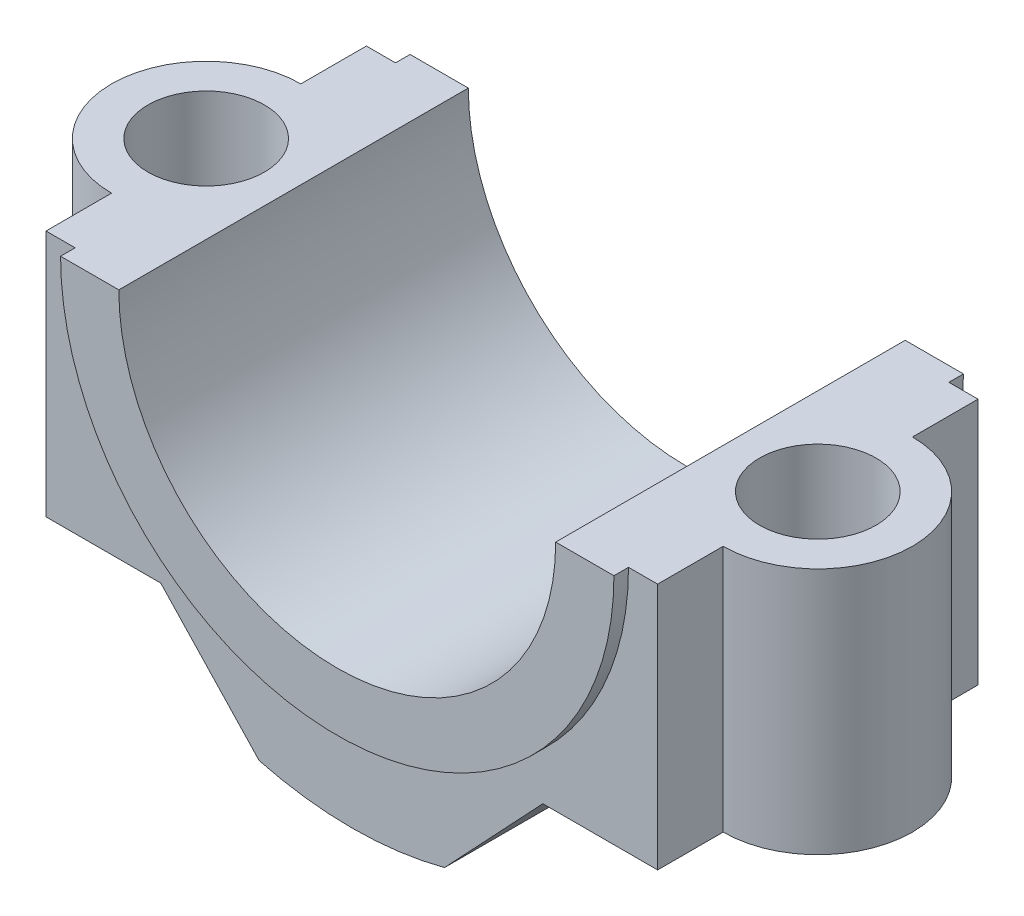
ISO-10303-21;
HEADER;
FILE_DESCRIPTION(('STEP AP214'),'2;1');
FILE_NAME('part.step','',(''),(''),'','','');
FILE_SCHEMA(('AUTOMOTIVE_DESIGN { 1 0 10303 214 1 1 1 1 }'));
ENDSEC;
DATA;
#1=APPLICATION_CONTEXT('core data for automotive mechanical design processes');
#2=APPLICATION_PROTOCOL_DEFINITION('international standard','automotive_design',2000,#1);
#3=PRODUCT_CONTEXT('',#1,'mechanical');
#4=PRODUCT('Part','Part','',(#3));
#5=PRODUCT_RELATED_PRODUCT_CATEGORY('part','',(#4));
#6=PRODUCT_DEFINITION_FORMATION('','',#4);
#7=PRODUCT_DEFINITION_CONTEXT('part definition',#1,'design');
#8=PRODUCT_DEFINITION('design','',#6,#7);
#9=PRODUCT_DEFINITION_SHAPE('','',#8);
#10=(LENGTH_UNIT() NAMED_UNIT(*) SI_UNIT(.MILLI.,.METRE.));
#11=(NAMED_UNIT(*) PLANE_ANGLE_UNIT() SI_UNIT($,.RADIAN.));
#12=(NAMED_UNIT(*) SI_UNIT($,.STERADIAN.) SOLID_ANGLE_UNIT());
#13=UNCERTAINTY_MEASURE_WITH_UNIT(LENGTH_MEASURE(1.E-05),#10,'distance_accuracy_value','');
#14=(GEOMETRIC_REPRESENTATION_CONTEXT(3) GLOBAL_UNCERTAINTY_ASSIGNED_CONTEXT((#13)) GLOBAL_UNIT_ASSIGNED_CONTEXT((#10,
#11,#12)) REPRESENTATION_CONTEXT('',''));
#15=CARTESIAN_POINT('',(0.,0.,0.));
#16=DIRECTION('',(0.,0.,1.));
#17=DIRECTION('',(1.,0.,0.));
#18=AXIS2_PLACEMENT_3D('',#15,#16,#17);
#19=CARTESIAN_POINT('',(0.,95.,-11.));
#20=DIRECTION('',(0.,-1.,0.));
#21=DIRECTION('',(0.,0.,-1.));
#22=AXIS2_PLACEMENT_3D('',#19,#20,#21);
#23=PLANE('',#22);
#24=CARTESIAN_POINT('',(21.,95.,0.));
#25=DIRECTION('',(0.,1.,0.));
#26=DIRECTION('',(0.,0.,1.));
#27=AXIS2_PLACEMENT_3D('',#24,#25,#26);
#28=CIRCLE('',#27,4.);
#29=CARTESIAN_POINT('',(21.,95.,4.));
#30=VERTEX_POINT('',#29);
#31=EDGE_CURVE('E231',#30,#30,#28,.T.);
#32=ORIENTED_EDGE('',*,*,#31,.F.);
#33=EDGE_LOOP('',(#32));
#34=FACE_BOUND('',#33,.T.);
#35=DIRECTION('',(0.,0.,1.));
#36=VECTOR('',#35,1.);
#37=CARTESIAN_POINT('',(21.,95.,-11.));
#38=LINE('',#37,#36);
#39=CARTESIAN_POINT('',(21.,95.,6.50000000000001));
#40=VERTEX_POINT('',#39);
#41=CARTESIAN_POINT('',(21.,95.,11.));
#42=VERTEX_POINT('',#41);
#43=EDGE_CURVE('E217',#40,#42,#38,.T.);
#44=ORIENTED_EDGE('',*,*,#43,.F.);
#45=CARTESIAN_POINT('',(21.,95.,0.));
#46=DIRECTION('',(0.,-1.,0.));
#47=DIRECTION('',(0.,0.,-1.));
#48=AXIS2_PLACEMENT_3D('',#45,#46,#47);
#49=CIRCLE('',#48,6.50000000000001);
#50=CARTESIAN_POINT('',(21.,95.,-6.50000000000001));
#51=VERTEX_POINT('',#50);
#52=EDGE_CURVE('E226',#51,#40,#49,.T.);
#53=ORIENTED_EDGE('',*,*,#52,.F.);
#54=DIRECTION('',(0.,0.,1.));
#55=VECTOR('',#54,1.);
#56=CARTESIAN_POINT('',(21.,95.,-11.));
#57=LINE('',#56,#55);
#58=CARTESIAN_POINT('',(21.,95.,-11.));
#59=VERTEX_POINT('',#58);
#60=EDGE_CURVE('E223',#59,#51,#57,.T.);
#61=ORIENTED_EDGE('',*,*,#60,.F.);
#62=DIRECTION('',(1.,0.,0.));
#63=VECTOR('',#62,1.);
#64=CARTESIAN_POINT('',(0.,95.,-11.));
#65=LINE('',#64,#63);
#66=CARTESIAN_POINT('',(19.,95.,-11.));
#67=VERTEX_POINT('',#66);
#68=EDGE_CURVE('E254',#67,#59,#65,.T.);
#69=ORIENTED_EDGE('',*,*,#68,.F.);
#70=DIRECTION('',(0.,0.,1.));
#71=VECTOR('',#70,1.);
#72=CARTESIAN_POINT('',(19.,95.,-12.));
#73=LINE('',#72,#71);
#74=CARTESIAN_POINT('',(19.,95.,-12.));
#75=VERTEX_POINT('',#74);
#76=EDGE_CURVE('E259',#75,#67,#73,.T.);
#77=ORIENTED_EDGE('',*,*,#76,.F.);
#78=DIRECTION('',(1.,0.,0.));
#79=VECTOR('',#78,1.);
#80=CARTESIAN_POINT('',(15.,95.,-12.));
#81=LINE('',#80,#79);
#82=CARTESIAN_POINT('',(15.,95.,-12.));
#83=VERTEX_POINT('',#82);
#84=EDGE_CURVE('E235',#83,#75,#81,.T.);
#85=ORIENTED_EDGE('',*,*,#84,.F.);
#86=DIRECTION('',(0.,0.,1.));
#87=VECTOR('',#86,1.);
#88=CARTESIAN_POINT('',(15.,95.,-11.));
#89=LINE('',#88,#87);
#90=CARTESIAN_POINT('',(15.,95.,12.));
#91=VERTEX_POINT('',#90);
#92=EDGE_CURVE('E271',#83,#91,#89,.T.);
#93=ORIENTED_EDGE('',*,*,#92,.T.);
#94=DIRECTION('',(1.,0.,0.));
#95=VECTOR('',#94,1.);
#96=CARTESIAN_POINT('',(15.,95.,12.));
#97=LINE('',#96,#95);
#98=CARTESIAN_POINT('',(19.,95.,12.));
#99=VERTEX_POINT('',#98);
#100=EDGE_CURVE('E249',#91,#99,#97,.T.);
#101=ORIENTED_EDGE('',*,*,#100,.T.);
#102=DIRECTION('',(0.,0.,-1.));
#103=VECTOR('',#102,1.);
#104=CARTESIAN_POINT('',(19.,95.,12.));
#105=LINE('',#104,#103);
#106=CARTESIAN_POINT('',(19.,95.,11.));
#107=VERTEX_POINT('',#106);
#108=EDGE_CURVE('E335',#99,#107,#105,.T.);
#109=ORIENTED_EDGE('',*,*,#108,.T.);
#110=DIRECTION('',(1.,0.,0.));
#111=VECTOR('',#110,1.);
#112=CARTESIAN_POINT('',(0.,95.,11.));
#113=LINE('',#112,#111);
#114=EDGE_CURVE('E281',#107,#42,#113,.T.);
#115=ORIENTED_EDGE('',*,*,#114,.T.);
#116=EDGE_LOOP('',(#44,#53,#61,#69,#77,#85,#93,#101,#109,#115));
#117=FACE_BOUND('',#116,.T.);
#118=ADVANCED_FACE('F36',(#34,#117),#23,.F.);
#119=CARTESIAN_POINT('',(0.,0.,11.));
#120=DIRECTION('',(0.,0.,1.));
#121=DIRECTION('',(1.,0.,0.));
#122=AXIS2_PLACEMENT_3D('',#119,#120,#121);
#123=PLANE('',#122);
#124=CARTESIAN_POINT('',(0.,95.,11.));
#125=DIRECTION('',(0.,0.,-1.));
#126=DIRECTION('',(-1.,0.,0.));
#127=AXIS2_PLACEMENT_3D('',#124,#125,#126);
#128=CIRCLE('',#127,19.);
#129=CARTESIAN_POINT('',(-19.,95.,11.));
#130=VERTEX_POINT('',#129);
#131=EDGE_CURVE('E264',#107,#130,#128,.T.);
#132=ORIENTED_EDGE('',*,*,#131,.T.);
#133=DIRECTION('',(1.,0.,0.));
#134=VECTOR('',#133,1.);
#135=CARTESIAN_POINT('',(0.,95.,11.));
#136=LINE('',#135,#134);
#137=CARTESIAN_POINT('',(-21.,95.,11.));
#138=VERTEX_POINT('',#137);
#139=EDGE_CURVE('E165',#138,#130,#136,.T.);
#140=ORIENTED_EDGE('',*,*,#139,.F.);
#141=DIRECTION('',(0.,-1.,0.));
#142=VECTOR('',#141,1.);
#143=CARTESIAN_POINT('',(-21.,95.00005,11.));
#144=LINE('',#143,#142);
#145=CARTESIAN_POINT('',(-21.,78.,11.));
#146=VERTEX_POINT('',#145);
#147=EDGE_CURVE('E160',#138,#146,#144,.T.);
#148=ORIENTED_EDGE('',*,*,#147,.T.);
#149=DIRECTION('',(-1.,0.,0.));
#150=VECTOR('',#149,1.);
#151=CARTESIAN_POINT('',(0.,78.,11.));
#152=LINE('',#151,#150);
#153=CARTESIAN_POINT('',(-13.1176470588236,78.,11.));
#154=VERTEX_POINT('',#153);
#155=EDGE_CURVE('E163',#154,#146,#152,.T.);
#156=ORIENTED_EDGE('',*,*,#155,.F.);
#157=DIRECTION('',(-0.685364699004992,0.728199992692802,0.));
#158=VECTOR('',#157,1.);
#159=CARTESIAN_POINT('',(31.9724770642202,30.0917431192661,11.));
#160=LINE('',#159,#158);
#161=CARTESIAN_POINT('',(-6.36315606092313,70.8233533147308,11.));
#162=VERTEX_POINT('',#161);
#163=EDGE_CURVE('E298',#154,#162,#160,.F.);
#164=ORIENTED_EDGE('',*,*,#163,.T.);
#165=CARTESIAN_POINT('',(0.,95.,11.));
#166=DIRECTION('',(0.,0.,1.));
#167=DIRECTION('',(1.,0.,0.));
#168=AXIS2_PLACEMENT_3D('',#165,#166,#167);
#169=CIRCLE('',#168,25.);
#170=CARTESIAN_POINT('',(6.36315606092294,70.8233533147308,11.));
#171=VERTEX_POINT('',#170);
#172=EDGE_CURVE('E285',#162,#171,#169,.T.);
#173=ORIENTED_EDGE('',*,*,#172,.T.);
#174=DIRECTION('',(-0.685364699004994,-0.7281999926928,0.));
#175=VECTOR('',#174,1.);
#176=CARTESIAN_POINT('',(-31.9724770642203,30.0917431192664,11.));
#177=LINE('',#176,#175);
#178=CARTESIAN_POINT('',(13.1176470588234,78.,11.));
#179=VERTEX_POINT('',#178);
#180=EDGE_CURVE('E307',#171,#179,#177,.F.);
#181=ORIENTED_EDGE('',*,*,#180,.T.);
#182=CARTESIAN_POINT('',(21.,78.,11.));
#183=VERTEX_POINT('',#182);
#184=EDGE_CURVE('E180',#183,#179,#152,.T.);
#185=ORIENTED_EDGE('',*,*,#184,.F.);
#186=DIRECTION('',(0.,-1.,0.));
#187=VECTOR('',#186,1.);
#188=CARTESIAN_POINT('',(21.,95.00005,11.));
#189=LINE('',#188,#187);
#190=EDGE_CURVE('E215',#42,#183,#189,.T.);
#191=ORIENTED_EDGE('',*,*,#190,.F.);
#192=ORIENTED_EDGE('',*,*,#114,.F.);
#193=EDGE_LOOP('',(#132,#140,#148,#156,#164,#173,#181,#185,#191,#192));
#194=FACE_BOUND('',#193,.T.);
#195=ADVANCED_FACE('F162',(#194),#123,.T.);
#196=CARTESIAN_POINT('',(0.,0.,-11.));
#197=DIRECTION('',(0.,0.,1.));
#198=DIRECTION('',(1.,0.,0.));
#199=AXIS2_PLACEMENT_3D('',#196,#197,#198);
#200=PLANE('',#199);
#201=DIRECTION('',(0.685364699004992,-0.728199992692802,0.));
#202=VECTOR('',#201,1.);
#203=CARTESIAN_POINT('',(-15.0000000000001,80.0000000000001,-11.));
#204=LINE('',#203,#202);
#205=CARTESIAN_POINT('',(-6.36315606092314,70.8233533147308,-11.));
#206=VERTEX_POINT('',#205);
#207=CARTESIAN_POINT('',(-13.1176470588236,78.,-11.));
#208=VERTEX_POINT('',#207);
#209=EDGE_CURVE('E302',#206,#208,#204,.F.);
#210=ORIENTED_EDGE('',*,*,#209,.T.);
#211=DIRECTION('',(1.,0.,0.));
#212=VECTOR('',#211,1.);
#213=CARTESIAN_POINT('',(0.,78.,-11.));
#214=LINE('',#213,#212);
#215=CARTESIAN_POINT('',(-21.,78.,-11.));
#216=VERTEX_POINT('',#215);
#217=EDGE_CURVE('E195',#216,#208,#214,.T.);
#218=ORIENTED_EDGE('',*,*,#217,.F.);
#219=DIRECTION('',(0.,-1.,0.));
#220=VECTOR('',#219,1.);
#221=CARTESIAN_POINT('',(-21.,95.00005,-11.));
#222=LINE('',#221,#220);
#223=CARTESIAN_POINT('',(-21.,95.,-11.));
#224=VERTEX_POINT('',#223);
#225=EDGE_CURVE('E170',#224,#216,#222,.T.);
#226=ORIENTED_EDGE('',*,*,#225,.F.);
#227=DIRECTION('',(1.,0.,0.));
#228=VECTOR('',#227,1.);
#229=CARTESIAN_POINT('',(0.,95.,-11.));
#230=LINE('',#229,#228);
#231=CARTESIAN_POINT('',(-19.,95.,-11.));
#232=VERTEX_POINT('',#231);
#233=EDGE_CURVE('E267',#224,#232,#230,.T.);
#234=ORIENTED_EDGE('',*,*,#233,.T.);
#235=CARTESIAN_POINT('',(0.,95.,-11.));
#236=DIRECTION('',(0.,0.,-1.));
#237=DIRECTION('',(-1.,0.,0.));
#238=AXIS2_PLACEMENT_3D('',#235,#236,#237);
#239=CIRCLE('',#238,19.);
#240=EDGE_CURVE('E234',#67,#232,#239,.T.);
#241=ORIENTED_EDGE('',*,*,#240,.F.);
#242=ORIENTED_EDGE('',*,*,#68,.T.);
#243=DIRECTION('',(0.,-1.,0.));
#244=VECTOR('',#243,1.);
#245=CARTESIAN_POINT('',(21.,95.00005,-11.));
#246=LINE('',#245,#244);
#247=CARTESIAN_POINT('',(21.,78.,-11.));
#248=VERTEX_POINT('',#247);
#249=EDGE_CURVE('E221',#59,#248,#246,.T.);
#250=ORIENTED_EDGE('',*,*,#249,.T.);
#251=CARTESIAN_POINT('',(13.1176470588234,78.,-11.));
#252=VERTEX_POINT('',#251);
#253=EDGE_CURVE('E194',#252,#248,#214,.T.);
#254=ORIENTED_EDGE('',*,*,#253,.F.);
#255=DIRECTION('',(0.685364699004994,0.7281999926928,0.));
#256=VECTOR('',#255,1.);
#257=CARTESIAN_POINT('',(6.36315606092294,70.8233533147308,-11.));
#258=LINE('',#257,#256);
#259=CARTESIAN_POINT('',(6.36315606092294,70.8233533147308,-11.));
#260=VERTEX_POINT('',#259);
#261=EDGE_CURVE('E44',#252,#260,#258,.F.);
#262=ORIENTED_EDGE('',*,*,#261,.T.);
#263=CARTESIAN_POINT('',(0.,95.,-11.));
#264=DIRECTION('',(0.,0.,1.));
#265=DIRECTION('',(1.,0.,0.));
#266=AXIS2_PLACEMENT_3D('',#263,#264,#265);
#267=CIRCLE('',#266,25.);
#268=EDGE_CURVE('E292',#206,#260,#267,.T.);
#269=ORIENTED_EDGE('',*,*,#268,.F.);
#270=EDGE_LOOP('',(#210,#218,#226,#234,#241,#242,#250,#254,#262,#269));
#271=FACE_BOUND('',#270,.T.);
#272=ADVANCED_FACE('F312',(#271),#200,.F.);
#273=CARTESIAN_POINT('',(0.,95.,-11.));
#274=DIRECTION('',(0.,-1.,0.));
#275=DIRECTION('',(0.,0.,-1.));
#276=AXIS2_PLACEMENT_3D('',#273,#274,#275);
#277=PLANE('',#276);
#278=CARTESIAN_POINT('',(-21.,95.,0.));
#279=DIRECTION('',(0.,1.,0.));
#280=DIRECTION('',(0.,0.,1.));
#281=AXIS2_PLACEMENT_3D('',#278,#279,#280);
#282=CIRCLE('',#281,4.);
#283=CARTESIAN_POINT('',(-21.,95.,4.));
#284=VERTEX_POINT('',#283);
#285=EDGE_CURVE('E228',#284,#284,#282,.T.);
#286=ORIENTED_EDGE('',*,*,#285,.F.);
#287=EDGE_LOOP('',(#286));
#288=FACE_BOUND('',#287,.T.);
#289=CARTESIAN_POINT('',(-21.,95.,0.));
#290=DIRECTION('',(0.,-1.,0.));
#291=DIRECTION('',(0.,0.,-1.));
#292=AXIS2_PLACEMENT_3D('',#289,#290,#291);
#293=CIRCLE('',#292,6.50000000000001);
#294=CARTESIAN_POINT('',(-21.,95.,-6.50000000000001));
#295=VERTEX_POINT('',#294);
#296=CARTESIAN_POINT('',(-21.,95.,6.50000000000001));
#297=VERTEX_POINT('',#296);
#298=EDGE_CURVE('E295',#295,#297,#293,.F.);
#299=ORIENTED_EDGE('',*,*,#298,.T.);
#300=DIRECTION('',(0.,0.,1.));
#301=VECTOR('',#300,1.);
#302=CARTESIAN_POINT('',(-21.,95.,-11.));
#303=LINE('',#302,#301);
#304=EDGE_CURVE('E296',#297,#138,#303,.T.);
#305=ORIENTED_EDGE('',*,*,#304,.T.);
#306=ORIENTED_EDGE('',*,*,#139,.T.);
#307=DIRECTION('',(0.,0.,-1.));
#308=VECTOR('',#307,1.);
#309=CARTESIAN_POINT('',(-19.,95.,12.));
#310=LINE('',#309,#308);
#311=CARTESIAN_POINT('',(-19.,95.,12.));
#312=VERTEX_POINT('',#311);
#313=EDGE_CURVE('E341',#312,#130,#310,.T.);
#314=ORIENTED_EDGE('',*,*,#313,.F.);
#315=DIRECTION('',(1.,0.,0.));
#316=VECTOR('',#315,1.);
#317=CARTESIAN_POINT('',(-19.,95.,12.));
#318=LINE('',#317,#316);
#319=CARTESIAN_POINT('',(-15.,95.,12.));
#320=VERTEX_POINT('',#319);
#321=EDGE_CURVE('E347',#312,#320,#318,.T.);
#322=ORIENTED_EDGE('',*,*,#321,.T.);
#323=DIRECTION('',(0.,0.,1.));
#324=VECTOR('',#323,1.);
#325=CARTESIAN_POINT('',(-15.,95.,-11.));
#326=LINE('',#325,#324);
#327=CARTESIAN_POINT('',(-15.,95.,-12.));
#328=VERTEX_POINT('',#327);
#329=EDGE_CURVE('E278',#328,#320,#326,.T.);
#330=ORIENTED_EDGE('',*,*,#329,.F.);
#331=DIRECTION('',(1.,0.,0.));
#332=VECTOR('',#331,1.);
#333=CARTESIAN_POINT('',(-19.,95.,-12.));
#334=LINE('',#333,#332);
#335=CARTESIAN_POINT('',(-19.,95.,-12.));
#336=VERTEX_POINT('',#335);
#337=EDGE_CURVE('E241',#336,#328,#334,.T.);
#338=ORIENTED_EDGE('',*,*,#337,.F.);
#339=DIRECTION('',(0.,0.,1.));
#340=VECTOR('',#339,1.);
#341=CARTESIAN_POINT('',(-19.,95.,-12.));
#342=LINE('',#341,#340);
#343=EDGE_CURVE('E246',#336,#232,#342,.T.);
#344=ORIENTED_EDGE('',*,*,#343,.T.);
#345=ORIENTED_EDGE('',*,*,#233,.F.);
#346=DIRECTION('',(0.,0.,1.));
#347=VECTOR('',#346,1.);
#348=CARTESIAN_POINT('',(-21.,95.,-11.));
#349=LINE('',#348,#347);
#350=EDGE_CURVE('E272',#224,#295,#349,.T.);
#351=ORIENTED_EDGE('',*,*,#350,.T.);
#352=EDGE_LOOP('',(#299,#305,#306,#314,#322,#330,#338,#344,#345,#351));
#353=FACE_BOUND('',#352,.T.);
#354=ADVANCED_FACE('F361',(#288,#353),#277,.F.);
#355=CARTESIAN_POINT('',(0.,95.,-11.));
#356=DIRECTION('',(0.,0.,1.));
#357=DIRECTION('',(1.,0.,0.));
#358=AXIS2_PLACEMENT_3D('',#355,#356,#357);
#359=CYLINDRICAL_SURFACE('',#358,15.);
#360=ORIENTED_EDGE('',*,*,#329,.T.);
#361=CARTESIAN_POINT('',(0.,95.,12.));
#362=DIRECTION('',(0.,0.,1.));
#363=DIRECTION('',(1.,0.,0.));
#364=AXIS2_PLACEMENT_3D('',#361,#362,#363);
#365=CIRCLE('',#364,15.);
#366=EDGE_CURVE('E342',#320,#91,#365,.T.);
#367=ORIENTED_EDGE('',*,*,#366,.T.);
#368=ORIENTED_EDGE('',*,*,#92,.F.);
#369=CARTESIAN_POINT('',(0.,95.,-12.));
#370=DIRECTION('',(0.,0.,1.));
#371=DIRECTION('',(1.,0.,0.));
#372=AXIS2_PLACEMENT_3D('',#369,#370,#371);
#373=CIRCLE('',#372,15.);
#374=EDGE_CURVE('E238',#328,#83,#373,.T.);
#375=ORIENTED_EDGE('',*,*,#374,.F.);
#376=EDGE_LOOP('',(#360,#367,#368,#375));
#377=FACE_BOUND('',#376,.T.);
#378=ADVANCED_FACE('F355',(#377),#359,.F.);
#379=CARTESIAN_POINT('',(0.,95.,-11.));
#380=DIRECTION('',(0.,0.,1.));
#381=DIRECTION('',(1.,0.,0.));
#382=AXIS2_PLACEMENT_3D('',#379,#380,#381);
#383=CYLINDRICAL_SURFACE('',#382,25.);
#384=ORIENTED_EDGE('',*,*,#268,.T.);
#385=DIRECTION('',(0.,0.,1.));
#386=VECTOR('',#385,1.);
#387=CARTESIAN_POINT('',(6.36315606092294,70.8233533147308,-11.));
#388=LINE('',#387,#386);
#389=EDGE_CURVE('E304',#260,#171,#388,.T.);
#390=ORIENTED_EDGE('',*,*,#389,.T.);
#391=ORIENTED_EDGE('',*,*,#172,.F.);
#392=DIRECTION('',(0.,0.,1.));
#393=VECTOR('',#392,1.);
#394=CARTESIAN_POINT('',(-6.36315606092313,70.8233533147308,-11.));
#395=LINE('',#394,#393);
#396=EDGE_CURVE('E300',#162,#206,#395,.F.);
#397=ORIENTED_EDGE('',*,*,#396,.T.);
#398=EDGE_LOOP('',(#384,#390,#391,#397));
#399=FACE_BOUND('',#398,.T.);
#400=ADVANCED_FACE('F316',(#399),#383,.T.);
#401=CARTESIAN_POINT('',(0.,95.,12.));
#402=DIRECTION('',(0.,0.,-1.));
#403=DIRECTION('',(-1.,0.,0.));
#404=AXIS2_PLACEMENT_3D('',#401,#402,#403);
#405=CYLINDRICAL_SURFACE('',#404,19.);
#406=ORIENTED_EDGE('',*,*,#131,.F.);
#407=ORIENTED_EDGE('',*,*,#108,.F.);
#408=CARTESIAN_POINT('',(0.,95.,12.));
#409=DIRECTION('',(0.,0.,-1.));
#410=DIRECTION('',(-1.,0.,0.));
#411=AXIS2_PLACEMENT_3D('',#408,#409,#410);
#412=CIRCLE('',#411,19.);
#413=EDGE_CURVE('E346',#99,#312,#412,.T.);
#414=ORIENTED_EDGE('',*,*,#413,.T.);
#415=ORIENTED_EDGE('',*,*,#313,.T.);
#416=EDGE_LOOP('',(#406,#407,#414,#415));
#417=FACE_BOUND('',#416,.T.);
#418=ADVANCED_FACE('F345',(#417),#405,.T.);
#419=CARTESIAN_POINT('',(0.,95.,12.));
#420=DIRECTION('',(0.,0.,-1.));
#421=DIRECTION('',(-1.,0.,0.));
#422=AXIS2_PLACEMENT_3D('',#419,#420,#421);
#423=PLANE('',#422);
#424=ORIENTED_EDGE('',*,*,#100,.F.);
#425=ORIENTED_EDGE('',*,*,#366,.F.);
#426=ORIENTED_EDGE('',*,*,#321,.F.);
#427=ORIENTED_EDGE('',*,*,#413,.F.);
#428=EDGE_LOOP('',(#424,#425,#426,#427));
#429=FACE_BOUND('',#428,.T.);
#430=ADVANCED_FACE('F359',(#429),#423,.F.);
#431=CARTESIAN_POINT('',(0.,95.,-12.));
#432=DIRECTION('',(0.,0.,1.));
#433=DIRECTION('',(1.,0.,0.));
#434=AXIS2_PLACEMENT_3D('',#431,#432,#433);
#435=CYLINDRICAL_SURFACE('',#434,19.);
#436=ORIENTED_EDGE('',*,*,#240,.T.);
#437=ORIENTED_EDGE('',*,*,#343,.F.);
#438=CARTESIAN_POINT('',(0.,95.,-12.));
#439=DIRECTION('',(0.,0.,-1.));
#440=DIRECTION('',(-1.,0.,0.));
#441=AXIS2_PLACEMENT_3D('',#438,#439,#440);
#442=CIRCLE('',#441,19.);
#443=EDGE_CURVE('E244',#75,#336,#442,.T.);
#444=ORIENTED_EDGE('',*,*,#443,.F.);
#445=ORIENTED_EDGE('',*,*,#76,.T.);
#446=EDGE_LOOP('',(#436,#437,#444,#445));
#447=FACE_BOUND('',#446,.T.);
#448=ADVANCED_FACE('F378',(#447),#435,.T.);
#449=CARTESIAN_POINT('',(0.,95.,-12.));
#450=DIRECTION('',(0.,0.,1.));
#451=DIRECTION('',(-1.,0.,0.));
#452=AXIS2_PLACEMENT_3D('',#449,#450,#451);
#453=PLANE('',#452);
#454=ORIENTED_EDGE('',*,*,#84,.T.);
#455=ORIENTED_EDGE('',*,*,#443,.T.);
#456=ORIENTED_EDGE('',*,*,#337,.T.);
#457=ORIENTED_EDGE('',*,*,#374,.T.);
#458=EDGE_LOOP('',(#454,#455,#456,#457));
#459=FACE_BOUND('',#458,.T.);
#460=ADVANCED_FACE('F541',(#459),#453,.F.);
#461=CARTESIAN_POINT('',(21.,70.,0.));
#462=DIRECTION('',(0.,1.,0.));
#463=DIRECTION('',(0.,0.,1.));
#464=AXIS2_PLACEMENT_3D('',#461,#462,#463);
#465=CYLINDRICAL_SURFACE('',#464,4.);
#466=ORIENTED_EDGE('',*,*,#31,.T.);
#467=EDGE_LOOP('',(#466));
#468=FACE_BOUND('',#467,.T.);
#469=CARTESIAN_POINT('',(21.,78.,0.));
#470=DIRECTION('',(0.,-1.,0.));
#471=DIRECTION('',(0.,0.,-1.));
#472=AXIS2_PLACEMENT_3D('',#469,#470,#471);
#473=CIRCLE('',#472,4.);
#474=CARTESIAN_POINT('',(21.,78.,-4.));
#475=VERTEX_POINT('',#474);
#476=EDGE_CURVE('E206',#475,#475,#473,.T.);
#477=ORIENTED_EDGE('',*,*,#476,.T.);
#478=EDGE_LOOP('',(#477));
#479=FACE_BOUND('',#478,.T.);
#480=ADVANCED_FACE('F398',(#468,#479),#465,.F.);
#481=CARTESIAN_POINT('',(-21.,70.,0.));
#482=DIRECTION('',(0.,1.,0.));
#483=DIRECTION('',(0.,0.,1.));
#484=AXIS2_PLACEMENT_3D('',#481,#482,#483);
#485=CYLINDRICAL_SURFACE('',#484,4.);
#486=ORIENTED_EDGE('',*,*,#285,.T.);
#487=EDGE_LOOP('',(#486));
#488=FACE_BOUND('',#487,.T.);
#489=CARTESIAN_POINT('',(-21.,78.,0.));
#490=DIRECTION('',(0.,-1.,0.));
#491=DIRECTION('',(0.,0.,-1.));
#492=AXIS2_PLACEMENT_3D('',#489,#490,#491);
#493=CIRCLE('',#492,4.);
#494=CARTESIAN_POINT('',(-21.,78.,-4.));
#495=VERTEX_POINT('',#494);
#496=EDGE_CURVE('E181',#495,#495,#493,.F.);
#497=ORIENTED_EDGE('',*,*,#496,.F.);
#498=EDGE_LOOP('',(#497));
#499=FACE_BOUND('',#498,.T.);
#500=ADVANCED_FACE('F391',(#488,#499),#485,.F.);
#501=CARTESIAN_POINT('',(21.,95.00005,0.));
#502=DIRECTION('',(0.,-1.,0.));
#503=DIRECTION('',(0.,0.,-1.));
#504=AXIS2_PLACEMENT_3D('',#501,#502,#503);
#505=CYLINDRICAL_SURFACE('',#504,6.50000000000001);
#506=ORIENTED_EDGE('',*,*,#52,.T.);
#507=DIRECTION('',(0.,-1.,0.));
#508=VECTOR('',#507,1.);
#509=CARTESIAN_POINT('',(21.,95.00005,6.50000000000001));
#510=LINE('',#509,#508);
#511=CARTESIAN_POINT('',(21.,78.,6.50000000000001));
#512=VERTEX_POINT('',#511);
#513=EDGE_CURVE('E213',#40,#512,#510,.T.);
#514=ORIENTED_EDGE('',*,*,#513,.T.);
#515=CARTESIAN_POINT('',(21.,78.,0.));
#516=DIRECTION('',(0.,-1.,0.));
#517=DIRECTION('',(0.,0.,-1.));
#518=AXIS2_PLACEMENT_3D('',#515,#516,#517);
#519=CIRCLE('',#518,6.50000000000001);
#520=CARTESIAN_POINT('',(21.,78.,-6.50000000000001));
#521=VERTEX_POINT('',#520);
#522=EDGE_CURVE('E200',#521,#512,#519,.T.);
#523=ORIENTED_EDGE('',*,*,#522,.F.);
#524=DIRECTION('',(0.,-1.,0.));
#525=VECTOR('',#524,1.);
#526=CARTESIAN_POINT('',(21.,95.00005,-6.50000000000001));
#527=LINE('',#526,#525);
#528=EDGE_CURVE('E220',#51,#521,#527,.T.);
#529=ORIENTED_EDGE('',*,*,#528,.F.);
#530=EDGE_LOOP('',(#506,#514,#523,#529));
#531=FACE_BOUND('',#530,.T.);
#532=ADVANCED_FACE('F389',(#531),#505,.T.);
#533=CARTESIAN_POINT('',(21.,95.00005,0.));
#534=DIRECTION('',(1.,0.,0.));
#535=DIRECTION('',(0.,0.,-1.));
#536=AXIS2_PLACEMENT_3D('',#533,#534,#535);
#537=PLANE('',#536);
#538=ORIENTED_EDGE('',*,*,#60,.T.);
#539=ORIENTED_EDGE('',*,*,#528,.T.);
#540=DIRECTION('',(0.,0.,1.));
#541=VECTOR('',#540,1.);
#542=CARTESIAN_POINT('',(21.,78.,0.));
#543=LINE('',#542,#541);
#544=EDGE_CURVE('E197',#248,#521,#543,.T.);
#545=ORIENTED_EDGE('',*,*,#544,.F.);
#546=ORIENTED_EDGE('',*,*,#249,.F.);
#547=EDGE_LOOP('',(#538,#539,#545,#546));
#548=FACE_BOUND('',#547,.T.);
#549=ADVANCED_FACE('F386',(#548),#537,.T.);
#550=CARTESIAN_POINT('',(21.,95.00005,0.));
#551=DIRECTION('',(1.,0.,0.));
#552=DIRECTION('',(0.,0.,-1.));
#553=AXIS2_PLACEMENT_3D('',#550,#551,#552);
#554=PLANE('',#553);
#555=ORIENTED_EDGE('',*,*,#43,.T.);
#556=ORIENTED_EDGE('',*,*,#190,.T.);
#557=DIRECTION('',(0.,0.,1.));
#558=VECTOR('',#557,1.);
#559=CARTESIAN_POINT('',(21.,78.,0.));
#560=LINE('',#559,#558);
#561=EDGE_CURVE('E203',#512,#183,#560,.T.);
#562=ORIENTED_EDGE('',*,*,#561,.F.);
#563=ORIENTED_EDGE('',*,*,#513,.F.);
#564=EDGE_LOOP('',(#555,#556,#562,#563));
#565=FACE_BOUND('',#564,.T.);
#566=ADVANCED_FACE('F329',(#565),#554,.T.);
#567=CARTESIAN_POINT('',(-21.,95.00005,0.));
#568=DIRECTION('',(0.,-1.,0.));
#569=DIRECTION('',(0.,0.,-1.));
#570=AXIS2_PLACEMENT_3D('',#567,#568,#569);
#571=CYLINDRICAL_SURFACE('',#570,6.50000000000001);
#572=DIRECTION('',(0.,-1.,0.));
#573=VECTOR('',#572,1.);
#574=CARTESIAN_POINT('',(-21.,95.00005,-6.50000000000001));
#575=LINE('',#574,#573);
#576=CARTESIAN_POINT('',(-21.,78.,-6.50000000000001));
#577=VERTEX_POINT('',#576);
#578=EDGE_CURVE('E211',#295,#577,#575,.T.);
#579=ORIENTED_EDGE('',*,*,#578,.T.);
#580=CARTESIAN_POINT('',(-21.,78.,0.));
#581=DIRECTION('',(0.,-1.,0.));
#582=DIRECTION('',(0.,0.,-1.));
#583=AXIS2_PLACEMENT_3D('',#580,#581,#582);
#584=CIRCLE('',#583,6.50000000000001);
#585=CARTESIAN_POINT('',(-21.,78.,6.50000000000001));
#586=VERTEX_POINT('',#585);
#587=EDGE_CURVE('E185',#586,#577,#584,.T.);
#588=ORIENTED_EDGE('',*,*,#587,.F.);
#589=DIRECTION('',(0.,-1.,0.));
#590=VECTOR('',#589,1.);
#591=CARTESIAN_POINT('',(-21.,95.00005,6.50000000000001));
#592=LINE('',#591,#590);
#593=EDGE_CURVE('E171',#297,#586,#592,.T.);
#594=ORIENTED_EDGE('',*,*,#593,.F.);
#595=ORIENTED_EDGE('',*,*,#298,.F.);
#596=EDGE_LOOP('',(#579,#588,#594,#595));
#597=FACE_BOUND('',#596,.T.);
#598=ADVANCED_FACE('F369',(#597),#571,.T.);
#599=CARTESIAN_POINT('',(-21.,95.00005,0.));
#600=DIRECTION('',(1.,0.,0.));
#601=DIRECTION('',(0.,0.,-1.));
#602=AXIS2_PLACEMENT_3D('',#599,#600,#601);
#603=PLANE('',#602);
#604=ORIENTED_EDGE('',*,*,#225,.T.);
#605=DIRECTION('',(0.,0.,-1.));
#606=VECTOR('',#605,1.);
#607=CARTESIAN_POINT('',(-21.,78.,0.));
#608=LINE('',#607,#606);
#609=EDGE_CURVE('E187',#577,#216,#608,.T.);
#610=ORIENTED_EDGE('',*,*,#609,.F.);
#611=ORIENTED_EDGE('',*,*,#578,.F.);
#612=ORIENTED_EDGE('',*,*,#350,.F.);
#613=EDGE_LOOP('',(#604,#610,#611,#612));
#614=FACE_BOUND('',#613,.T.);
#615=ADVANCED_FACE('F373',(#614),#603,.F.);
#616=CARTESIAN_POINT('',(-21.,95.00005,0.));
#617=DIRECTION('',(1.,0.,0.));
#618=DIRECTION('',(0.,0.,-1.));
#619=AXIS2_PLACEMENT_3D('',#616,#617,#618);
#620=PLANE('',#619);
#621=ORIENTED_EDGE('',*,*,#593,.T.);
#622=DIRECTION('',(0.,0.,-1.));
#623=VECTOR('',#622,1.);
#624=CARTESIAN_POINT('',(-21.,78.,0.));
#625=LINE('',#624,#623);
#626=EDGE_CURVE('E178',#146,#586,#625,.T.);
#627=ORIENTED_EDGE('',*,*,#626,.F.);
#628=ORIENTED_EDGE('',*,*,#147,.F.);
#629=ORIENTED_EDGE('',*,*,#304,.F.);
#630=EDGE_LOOP('',(#621,#627,#628,#629));
#631=FACE_BOUND('',#630,.T.);
#632=ADVANCED_FACE('F183',(#631),#620,.F.);
#633=CARTESIAN_POINT('',(-15.0000000000001,80.0000000000001,-11.));
#634=DIRECTION('',(0.728199992692802,0.685364699004992,0.));
#635=DIRECTION('',(0.,0.,1.));
#636=AXIS2_PLACEMENT_3D('',#633,#634,#635);
#637=PLANE('',#636);
#638=DIRECTION('',(0.,0.,-1.));
#639=VECTOR('',#638,1.);
#640=CARTESIAN_POINT('',(-13.1176470588236,78.,-11.));
#641=LINE('',#640,#639);
#642=EDGE_CURVE('E51',#208,#154,#641,.F.);
#643=ORIENTED_EDGE('',*,*,#642,.F.);
#644=ORIENTED_EDGE('',*,*,#209,.F.);
#645=ORIENTED_EDGE('',*,*,#396,.F.);
#646=ORIENTED_EDGE('',*,*,#163,.F.);
#647=EDGE_LOOP('',(#643,#644,#645,#646));
#648=FACE_BOUND('',#647,.T.);
#649=ADVANCED_FACE('F413',(#648),#637,.F.);
#650=CARTESIAN_POINT('',(6.36315606092294,70.8233533147308,-11.));
#651=DIRECTION('',(-0.7281999926928,0.685364699004994,0.));
#652=DIRECTION('',(0.,0.,1.));
#653=AXIS2_PLACEMENT_3D('',#650,#651,#652);
#654=PLANE('',#653);
#655=DIRECTION('',(0.,0.,1.));
#656=VECTOR('',#655,1.);
#657=CARTESIAN_POINT('',(13.1176470588234,78.,-11.));
#658=LINE('',#657,#656);
#659=EDGE_CURVE('E11',#179,#252,#658,.F.);
#660=ORIENTED_EDGE('',*,*,#659,.F.);
#661=ORIENTED_EDGE('',*,*,#180,.F.);
#662=ORIENTED_EDGE('',*,*,#389,.F.);
#663=ORIENTED_EDGE('',*,*,#261,.F.);
#664=EDGE_LOOP('',(#660,#661,#662,#663));
#665=FACE_BOUND('',#664,.T.);
#666=ADVANCED_FACE('F38',(#665),#654,.F.);
#667=CARTESIAN_POINT('',(0.,78.,0.));
#668=DIRECTION('',(0.,-1.,0.));
#669=DIRECTION('',(0.,0.,-1.));
#670=AXIS2_PLACEMENT_3D('',#667,#668,#669);
#671=PLANE('',#670);
#672=ORIENTED_EDGE('',*,*,#184,.T.);
#673=ORIENTED_EDGE('',*,*,#659,.T.);
#674=ORIENTED_EDGE('',*,*,#253,.T.);
#675=ORIENTED_EDGE('',*,*,#544,.T.);
#676=ORIENTED_EDGE('',*,*,#522,.T.);
#677=ORIENTED_EDGE('',*,*,#561,.T.);
#678=EDGE_LOOP('',(#672,#673,#674,#675,#676,#677));
#679=FACE_BOUND('',#678,.T.);
#680=ORIENTED_EDGE('',*,*,#476,.F.);
#681=EDGE_LOOP('',(#680));
#682=FACE_BOUND('',#681,.T.);
#683=ADVANCED_FACE('F323',(#679,#682),#671,.T.);
#684=ORIENTED_EDGE('',*,*,#496,.T.);
#685=EDGE_LOOP('',(#684));
#686=FACE_BOUND('',#685,.T.);
#687=ORIENTED_EDGE('',*,*,#217,.T.);
#688=ORIENTED_EDGE('',*,*,#642,.T.);
#689=ORIENTED_EDGE('',*,*,#155,.T.);
#690=ORIENTED_EDGE('',*,*,#626,.T.);
#691=ORIENTED_EDGE('',*,*,#587,.T.);
#692=ORIENTED_EDGE('',*,*,#609,.T.);
#693=EDGE_LOOP('',(#687,#688,#689,#690,#691,#692));
#694=FACE_BOUND('',#693,.T.);
#695=ADVANCED_FACE('F176',(#686,#694),#671,.T.);
#696=CLOSED_SHELL('',(#118,#195,#272,#354,#378,#400,#418,#430,#448,#460,#480,#500,#532,#549,
#566,#598,#615,#632,#649,#666,#683,#695));
#697=MANIFOLD_SOLID_BREP('B2',#696);
#698=ADVANCED_BREP_SHAPE_REPRESENTATION('',(#18,#697),#14);
#699=SHAPE_DEFINITION_REPRESENTATION(#9,#698);
ENDSEC;
END-ISO-10303-21;
